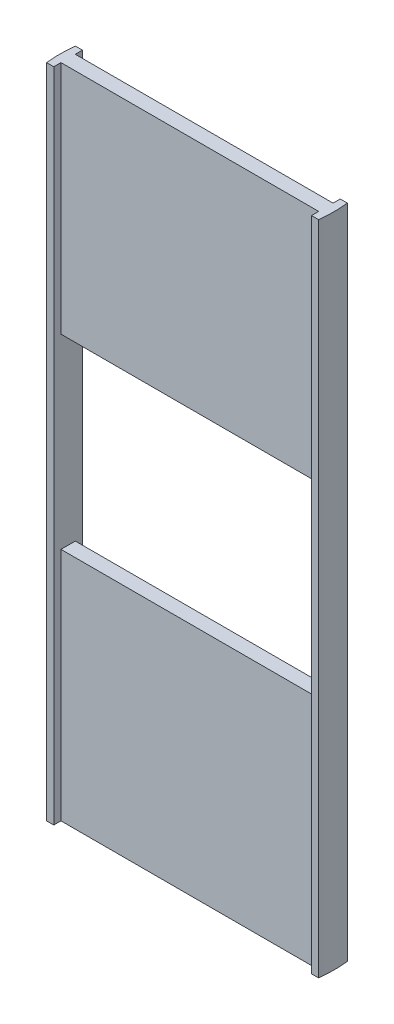
ISO-10303-21;
HEADER;
FILE_DESCRIPTION(('STEP AP214'),'2;1');
FILE_NAME('part.step','',(''),(''),'','','');
FILE_SCHEMA(('AUTOMOTIVE_DESIGN { 1 0 10303 214 1 1 1 1 }'));
ENDSEC;
DATA;
#1=APPLICATION_CONTEXT('core data for automotive mechanical design processes');
#2=APPLICATION_PROTOCOL_DEFINITION('international standard','automotive_design',2000,#1);
#3=PRODUCT_CONTEXT('',#1,'mechanical');
#4=PRODUCT('Part','Part','',(#3));
#5=PRODUCT_RELATED_PRODUCT_CATEGORY('part','',(#4));
#6=PRODUCT_DEFINITION_FORMATION('','',#4);
#7=PRODUCT_DEFINITION_CONTEXT('part definition',#1,'design');
#8=PRODUCT_DEFINITION('design','',#6,#7);
#9=PRODUCT_DEFINITION_SHAPE('','',#8);
#10=(LENGTH_UNIT() NAMED_UNIT(*) SI_UNIT(.MILLI.,.METRE.));
#11=(NAMED_UNIT(*) PLANE_ANGLE_UNIT() SI_UNIT($,.RADIAN.));
#12=(NAMED_UNIT(*) SI_UNIT($,.STERADIAN.) SOLID_ANGLE_UNIT());
#13=UNCERTAINTY_MEASURE_WITH_UNIT(LENGTH_MEASURE(1.E-05),#10,'distance_accuracy_value','');
#14=(GEOMETRIC_REPRESENTATION_CONTEXT(3) GLOBAL_UNCERTAINTY_ASSIGNED_CONTEXT((#13)) GLOBAL_UNIT_ASSIGNED_CONTEXT((#10,
#11,#12)) REPRESENTATION_CONTEXT('',''));
#15=CARTESIAN_POINT('',(0.,0.,0.));
#16=DIRECTION('',(0.,0.,1.));
#17=DIRECTION('',(1.,0.,0.));
#18=AXIS2_PLACEMENT_3D('',#15,#16,#17);
#19=CARTESIAN_POINT('',(89.7236111009288,0.,-5.));
#20=DIRECTION('',(0.,0.,-1.));
#21=DIRECTION('',(-1.,0.,0.));
#22=AXIS2_PLACEMENT_3D('',#19,#20,#21);
#23=PLANE('',#22);
#24=DIRECTION('',(-1.,0.,0.));
#25=VECTOR('',#24,1.);
#26=CARTESIAN_POINT('',(89.7236111009288,163.713787480197,-5.));
#27=LINE('',#26,#25);
#28=CARTESIAN_POINT('',(89.7236111009288,163.713787480197,-4.99999999999999));
#29=VERTEX_POINT('',#28);
#30=CARTESIAN_POINT('',(-89.7236111009288,163.713787480197,-4.99999999999998));
#31=VERTEX_POINT('',#30);
#32=EDGE_CURVE('E251',#29,#31,#27,.T.);
#33=ORIENTED_EDGE('',*,*,#32,.F.);
#34=DIRECTION('',(0.,1.,0.));
#35=VECTOR('',#34,1.);
#36=CARTESIAN_POINT('',(89.7236111009288,0.,-5.));
#37=LINE('',#36,#35);
#38=CARTESIAN_POINT('',(89.7236111009288,0.,-5.));
#39=VERTEX_POINT('',#38);
#40=EDGE_CURVE('E211',#39,#29,#37,.T.);
#41=ORIENTED_EDGE('',*,*,#40,.F.);
#42=DIRECTION('',(-1.,0.,0.));
#43=VECTOR('',#42,1.);
#44=CARTESIAN_POINT('',(89.7236111009288,0.,-5.));
#45=LINE('',#44,#43);
#46=CARTESIAN_POINT('',(-89.7236111009288,0.,-4.99999999999998));
#47=VERTEX_POINT('',#46);
#48=EDGE_CURVE('E178',#39,#47,#45,.T.);
#49=ORIENTED_EDGE('',*,*,#48,.T.);
#50=DIRECTION('',(0.,1.,0.));
#51=VECTOR('',#50,1.);
#52=CARTESIAN_POINT('',(-89.7236111009288,0.,-4.99999999999998));
#53=LINE('',#52,#51);
#54=EDGE_CURVE('E207',#47,#31,#53,.T.);
#55=ORIENTED_EDGE('',*,*,#54,.T.);
#56=EDGE_LOOP('',(#33,#41,#49,#55));
#57=FACE_BOUND('',#56,.T.);
#58=ADVANCED_FACE('F34',(#57),#23,.T.);
#59=CARTESIAN_POINT('',(0.,0.,5.));
#60=DIRECTION('',(0.,0.,-1.));
#61=DIRECTION('',(-1.,0.,0.));
#62=AXIS2_PLACEMENT_3D('',#59,#60,#61);
#63=PLANE('',#62);
#64=DIRECTION('',(0.,1.,0.));
#65=VECTOR('',#64,1.);
#66=CARTESIAN_POINT('',(89.7236111009288,0.,5.));
#67=LINE('',#66,#65);
#68=CARTESIAN_POINT('',(89.7236111009288,0.,5.));
#69=VERTEX_POINT('',#68);
#70=CARTESIAN_POINT('',(89.7236111009288,163.713787480197,5.));
#71=VERTEX_POINT('',#70);
#72=EDGE_CURVE('E191',#69,#71,#67,.T.);
#73=ORIENTED_EDGE('',*,*,#72,.T.);
#74=DIRECTION('',(-1.,0.,0.));
#75=VECTOR('',#74,1.);
#76=CARTESIAN_POINT('',(0.,163.713787480197,5.));
#77=LINE('',#76,#75);
#78=CARTESIAN_POINT('',(-89.7236111009288,163.713787480197,5.));
#79=VERTEX_POINT('',#78);
#80=EDGE_CURVE('E11',#71,#79,#77,.T.);
#81=ORIENTED_EDGE('',*,*,#80,.T.);
#82=DIRECTION('',(0.,1.,0.));
#83=VECTOR('',#82,1.);
#84=CARTESIAN_POINT('',(-89.7236111009288,0.,5.));
#85=LINE('',#84,#83);
#86=CARTESIAN_POINT('',(-89.7236111009288,0.,5.));
#87=VERTEX_POINT('',#86);
#88=EDGE_CURVE('E162',#87,#79,#85,.T.);
#89=ORIENTED_EDGE('',*,*,#88,.F.);
#90=DIRECTION('',(-1.,0.,0.));
#91=VECTOR('',#90,1.);
#92=CARTESIAN_POINT('',(0.,0.,5.));
#93=LINE('',#92,#91);
#94=EDGE_CURVE('E262',#69,#87,#93,.T.);
#95=ORIENTED_EDGE('',*,*,#94,.F.);
#96=EDGE_LOOP('',(#73,#81,#89,#95));
#97=FACE_BOUND('',#96,.T.);
#98=ADVANCED_FACE('F301',(#97),#63,.F.);
#99=CARTESIAN_POINT('',(0.,457.2,0.));
#100=DIRECTION('',(0.,-1.,0.));
#101=DIRECTION('',(0.,0.,-1.));
#102=AXIS2_PLACEMENT_3D('',#99,#100,#101);
#103=CYLINDRICAL_SURFACE('',#102,95.25);
#104=CARTESIAN_POINT('',(0.,457.2,0.));
#105=DIRECTION('',(0.,1.,0.));
#106=DIRECTION('',(0.,0.,1.));
#107=AXIS2_PLACEMENT_3D('',#104,#105,#106);
#108=CIRCLE('',#107,95.25);
#109=CARTESIAN_POINT('',(94.7236111009288,457.2,9.99999999999996));
#110=VERTEX_POINT('',#109);
#111=CARTESIAN_POINT('',(94.7236111009288,457.2,-9.99999999999999));
#112=VERTEX_POINT('',#111);
#113=EDGE_CURVE('E219',#110,#112,#108,.T.);
#114=ORIENTED_EDGE('',*,*,#113,.F.);
#115=DIRECTION('',(0.,1.,0.));
#116=VECTOR('',#115,1.);
#117=CARTESIAN_POINT('',(94.7236111009288,0.,9.99999999999996));
#118=LINE('',#117,#116);
#119=CARTESIAN_POINT('',(94.7236111009288,0.,9.99999999999996));
#120=VERTEX_POINT('',#119);
#121=EDGE_CURVE('E232',#120,#110,#118,.T.);
#122=ORIENTED_EDGE('',*,*,#121,.F.);
#123=CARTESIAN_POINT('',(0.,0.,0.));
#124=DIRECTION('',(0.,1.,0.));
#125=DIRECTION('',(0.,0.,1.));
#126=AXIS2_PLACEMENT_3D('',#123,#124,#125);
#127=CIRCLE('',#126,95.25);
#128=CARTESIAN_POINT('',(94.7236111009288,0.,-9.99999999999999));
#129=VERTEX_POINT('',#128);
#130=EDGE_CURVE('E216',#120,#129,#127,.T.);
#131=ORIENTED_EDGE('',*,*,#130,.T.);
#132=DIRECTION('',(0.,1.,0.));
#133=VECTOR('',#132,1.);
#134=CARTESIAN_POINT('',(94.7236111009288,0.,-9.99999999999999));
#135=LINE('',#134,#133);
#136=EDGE_CURVE('E186',#129,#112,#135,.T.);
#137=ORIENTED_EDGE('',*,*,#136,.T.);
#138=EDGE_LOOP('',(#114,#122,#131,#137));
#139=FACE_BOUND('',#138,.T.);
#140=ADVANCED_FACE('F231',(#139),#103,.T.);
#141=CARTESIAN_POINT('',(-94.7236111009288,0.,-10.));
#142=VERTEX_POINT('',#141);
#143=CARTESIAN_POINT('',(-94.7236111009288,0.,10.));
#144=VERTEX_POINT('',#143);
#145=EDGE_CURVE('E220',#142,#144,#127,.T.);
#146=ORIENTED_EDGE('',*,*,#145,.T.);
#147=DIRECTION('',(0.,1.,0.));
#148=VECTOR('',#147,1.);
#149=CARTESIAN_POINT('',(-94.7236111009288,0.,10.));
#150=LINE('',#149,#148);
#151=CARTESIAN_POINT('',(-94.7236111009288,457.2,10.));
#152=VERTEX_POINT('',#151);
#153=EDGE_CURVE('E286',#144,#152,#150,.T.);
#154=ORIENTED_EDGE('',*,*,#153,.T.);
#155=CARTESIAN_POINT('',(-94.7236111009288,457.2,-10.));
#156=VERTEX_POINT('',#155);
#157=EDGE_CURVE('E147',#156,#152,#108,.T.);
#158=ORIENTED_EDGE('',*,*,#157,.F.);
#159=DIRECTION('',(0.,1.,0.));
#160=VECTOR('',#159,1.);
#161=CARTESIAN_POINT('',(-94.7236111009288,0.,-10.));
#162=LINE('',#161,#160);
#163=EDGE_CURVE('E203',#142,#156,#162,.T.);
#164=ORIENTED_EDGE('',*,*,#163,.F.);
#165=EDGE_LOOP('',(#146,#154,#158,#164));
#166=FACE_BOUND('',#165,.T.);
#167=ADVANCED_FACE('F36',(#166),#103,.T.);
#168=CARTESIAN_POINT('',(0.,457.2,0.));
#169=DIRECTION('',(0.,1.,0.));
#170=DIRECTION('',(0.,0.,1.));
#171=AXIS2_PLACEMENT_3D('',#168,#169,#170);
#172=PLANE('',#171);
#173=DIRECTION('',(-1.,0.,0.));
#174=VECTOR('',#173,1.);
#175=CARTESIAN_POINT('',(94.7236111009288,457.2,10.));
#176=LINE('',#175,#174);
#177=CARTESIAN_POINT('',(89.7236111009288,457.2,10.));
#178=VERTEX_POINT('',#177);
#179=EDGE_CURVE('E276',#110,#178,#176,.T.);
#180=ORIENTED_EDGE('',*,*,#179,.F.);
#181=ORIENTED_EDGE('',*,*,#113,.T.);
#182=DIRECTION('',(-1.,0.,0.));
#183=VECTOR('',#182,1.);
#184=CARTESIAN_POINT('',(94.7236111009288,457.2,-10.));
#185=LINE('',#184,#183);
#186=CARTESIAN_POINT('',(89.7236111009288,457.2,-10.));
#187=VERTEX_POINT('',#186);
#188=EDGE_CURVE('E187',#112,#187,#185,.T.);
#189=ORIENTED_EDGE('',*,*,#188,.T.);
#190=DIRECTION('',(0.,0.,1.));
#191=VECTOR('',#190,1.);
#192=CARTESIAN_POINT('',(89.7236111009288,457.2,-10.));
#193=LINE('',#192,#191);
#194=CARTESIAN_POINT('',(89.7236111009288,457.2,-5.));
#195=VERTEX_POINT('',#194);
#196=EDGE_CURVE('E190',#187,#195,#193,.T.);
#197=ORIENTED_EDGE('',*,*,#196,.T.);
#198=DIRECTION('',(-1.,0.,0.));
#199=VECTOR('',#198,1.);
#200=CARTESIAN_POINT('',(89.7236111009288,457.2,-5.));
#201=LINE('',#200,#199);
#202=CARTESIAN_POINT('',(-89.7236111009288,457.2,-4.99999999999998));
#203=VERTEX_POINT('',#202);
#204=EDGE_CURVE('E194',#195,#203,#201,.T.);
#205=ORIENTED_EDGE('',*,*,#204,.T.);
#206=DIRECTION('',(0.,0.,1.));
#207=VECTOR('',#206,1.);
#208=CARTESIAN_POINT('',(-89.7236111009288,457.2,-10.));
#209=LINE('',#208,#207);
#210=CARTESIAN_POINT('',(-89.7236111009288,457.2,-10.));
#211=VERTEX_POINT('',#210);
#212=EDGE_CURVE('E197',#211,#203,#209,.T.);
#213=ORIENTED_EDGE('',*,*,#212,.F.);
#214=DIRECTION('',(1.,0.,0.));
#215=VECTOR('',#214,1.);
#216=CARTESIAN_POINT('',(-94.7236111009288,457.2,-10.));
#217=LINE('',#216,#215);
#218=EDGE_CURVE('E176',#156,#211,#217,.T.);
#219=ORIENTED_EDGE('',*,*,#218,.F.);
#220=ORIENTED_EDGE('',*,*,#157,.T.);
#221=DIRECTION('',(-1.,0.,0.));
#222=VECTOR('',#221,1.);
#223=CARTESIAN_POINT('',(-89.7236111009288,457.2,10.));
#224=LINE('',#223,#222);
#225=CARTESIAN_POINT('',(-89.7236111009288,457.2,10.));
#226=VERTEX_POINT('',#225);
#227=EDGE_CURVE('E274',#226,#152,#224,.T.);
#228=ORIENTED_EDGE('',*,*,#227,.F.);
#229=DIRECTION('',(0.,0.,1.));
#230=VECTOR('',#229,1.);
#231=CARTESIAN_POINT('',(-89.7236111009288,457.2,5.));
#232=LINE('',#231,#230);
#233=CARTESIAN_POINT('',(-89.7236111009288,457.2,5.));
#234=VERTEX_POINT('',#233);
#235=EDGE_CURVE('E256',#234,#226,#232,.T.);
#236=ORIENTED_EDGE('',*,*,#235,.F.);
#237=DIRECTION('',(-1.,0.,0.));
#238=VECTOR('',#237,1.);
#239=CARTESIAN_POINT('',(0.,457.2,5.));
#240=LINE('',#239,#238);
#241=CARTESIAN_POINT('',(89.7236111009288,457.2,5.));
#242=VERTEX_POINT('',#241);
#243=EDGE_CURVE('E160',#242,#234,#240,.T.);
#244=ORIENTED_EDGE('',*,*,#243,.F.);
#245=DIRECTION('',(0.,0.,-1.));
#246=VECTOR('',#245,1.);
#247=CARTESIAN_POINT('',(89.7236111009288,457.2,5.));
#248=LINE('',#247,#246);
#249=EDGE_CURVE('E266',#178,#242,#248,.T.);
#250=ORIENTED_EDGE('',*,*,#249,.F.);
#251=EDGE_LOOP('',(#180,#181,#189,#197,#205,#213,#219,#220,#228,#236,#244,#250));
#252=FACE_BOUND('',#251,.T.);
#253=ADVANCED_FACE('F294',(#252),#172,.T.);
#254=CARTESIAN_POINT('',(0.,0.,0.));
#255=DIRECTION('',(0.,1.,0.));
#256=DIRECTION('',(0.,0.,1.));
#257=AXIS2_PLACEMENT_3D('',#254,#255,#256);
#258=PLANE('',#257);
#259=ORIENTED_EDGE('',*,*,#130,.F.);
#260=DIRECTION('',(-1.,0.,0.));
#261=VECTOR('',#260,1.);
#262=CARTESIAN_POINT('',(94.7236111009288,0.,10.));
#263=LINE('',#262,#261);
#264=CARTESIAN_POINT('',(89.7236111009288,0.,10.));
#265=VERTEX_POINT('',#264);
#266=EDGE_CURVE('E168',#120,#265,#263,.T.);
#267=ORIENTED_EDGE('',*,*,#266,.T.);
#268=DIRECTION('',(0.,0.,-1.));
#269=VECTOR('',#268,1.);
#270=CARTESIAN_POINT('',(89.7236111009288,0.,5.));
#271=LINE('',#270,#269);
#272=EDGE_CURVE('E163',#265,#69,#271,.T.);
#273=ORIENTED_EDGE('',*,*,#272,.T.);
#274=ORIENTED_EDGE('',*,*,#94,.T.);
#275=DIRECTION('',(0.,0.,1.));
#276=VECTOR('',#275,1.);
#277=CARTESIAN_POINT('',(-89.7236111009288,0.,5.));
#278=LINE('',#277,#276);
#279=CARTESIAN_POINT('',(-89.7236111009288,0.,10.));
#280=VERTEX_POINT('',#279);
#281=EDGE_CURVE('E265',#87,#280,#278,.T.);
#282=ORIENTED_EDGE('',*,*,#281,.T.);
#283=DIRECTION('',(-1.,0.,0.));
#284=VECTOR('',#283,1.);
#285=CARTESIAN_POINT('',(-89.7236111009288,0.,10.));
#286=LINE('',#285,#284);
#287=EDGE_CURVE('E269',#280,#144,#286,.T.);
#288=ORIENTED_EDGE('',*,*,#287,.T.);
#289=ORIENTED_EDGE('',*,*,#145,.F.);
#290=DIRECTION('',(1.,0.,0.));
#291=VECTOR('',#290,1.);
#292=CARTESIAN_POINT('',(-94.7236111009288,0.,-10.));
#293=LINE('',#292,#291);
#294=CARTESIAN_POINT('',(-89.7236111009288,0.,-10.));
#295=VERTEX_POINT('',#294);
#296=EDGE_CURVE('E183',#142,#295,#293,.T.);
#297=ORIENTED_EDGE('',*,*,#296,.T.);
#298=DIRECTION('',(0.,0.,1.));
#299=VECTOR('',#298,1.);
#300=CARTESIAN_POINT('',(-89.7236111009288,0.,-10.));
#301=LINE('',#300,#299);
#302=EDGE_CURVE('E180',#295,#47,#301,.T.);
#303=ORIENTED_EDGE('',*,*,#302,.T.);
#304=ORIENTED_EDGE('',*,*,#48,.F.);
#305=DIRECTION('',(0.,0.,1.));
#306=VECTOR('',#305,1.);
#307=CARTESIAN_POINT('',(89.7236111009288,0.,-10.));
#308=LINE('',#307,#306);
#309=CARTESIAN_POINT('',(89.7236111009288,0.,-10.));
#310=VERTEX_POINT('',#309);
#311=EDGE_CURVE('E175',#310,#39,#308,.T.);
#312=ORIENTED_EDGE('',*,*,#311,.F.);
#313=DIRECTION('',(-1.,0.,0.));
#314=VECTOR('',#313,1.);
#315=CARTESIAN_POINT('',(94.7236111009288,0.,-10.));
#316=LINE('',#315,#314);
#317=EDGE_CURVE('E173',#129,#310,#316,.T.);
#318=ORIENTED_EDGE('',*,*,#317,.F.);
#319=EDGE_LOOP('',(#259,#267,#273,#274,#282,#288,#289,#297,#303,#304,#312,#318));
#320=FACE_BOUND('',#319,.T.);
#321=ADVANCED_FACE('F241',(#320),#258,.F.);
#322=CARTESIAN_POINT('',(94.7236111009288,0.,-10.));
#323=DIRECTION('',(0.,0.,-1.));
#324=DIRECTION('',(-1.,0.,0.));
#325=AXIS2_PLACEMENT_3D('',#322,#323,#324);
#326=PLANE('',#325);
#327=ORIENTED_EDGE('',*,*,#188,.F.);
#328=ORIENTED_EDGE('',*,*,#136,.F.);
#329=ORIENTED_EDGE('',*,*,#317,.T.);
#330=DIRECTION('',(0.,1.,0.));
#331=VECTOR('',#330,1.);
#332=CARTESIAN_POINT('',(89.7236111009288,0.,-10.));
#333=LINE('',#332,#331);
#334=EDGE_CURVE('E214',#310,#187,#333,.T.);
#335=ORIENTED_EDGE('',*,*,#334,.T.);
#336=EDGE_LOOP('',(#327,#328,#329,#335));
#337=FACE_BOUND('',#336,.T.);
#338=ADVANCED_FACE('F238',(#337),#326,.T.);
#339=CARTESIAN_POINT('',(89.7236111009288,0.,-10.));
#340=DIRECTION('',(-1.,0.,0.));
#341=DIRECTION('',(0.,0.,1.));
#342=AXIS2_PLACEMENT_3D('',#339,#340,#341);
#343=PLANE('',#342);
#344=ORIENTED_EDGE('',*,*,#196,.F.);
#345=ORIENTED_EDGE('',*,*,#334,.F.);
#346=ORIENTED_EDGE('',*,*,#311,.T.);
#347=ORIENTED_EDGE('',*,*,#40,.T.);
#348=DIRECTION('',(0.,0.,1.));
#349=VECTOR('',#348,1.);
#350=CARTESIAN_POINT('',(89.7236111009288,163.713787480197,-10.));
#351=LINE('',#350,#349);
#352=EDGE_CURVE('E258',#29,#71,#351,.T.);
#353=ORIENTED_EDGE('',*,*,#352,.T.);
#354=ORIENTED_EDGE('',*,*,#72,.F.);
#355=ORIENTED_EDGE('',*,*,#272,.F.);
#356=DIRECTION('',(0.,1.,0.));
#357=VECTOR('',#356,1.);
#358=CARTESIAN_POINT('',(89.7236111009288,0.,10.));
#359=LINE('',#358,#357);
#360=EDGE_CURVE('E284',#265,#178,#359,.T.);
#361=ORIENTED_EDGE('',*,*,#360,.T.);
#362=ORIENTED_EDGE('',*,*,#249,.T.);
#363=CARTESIAN_POINT('',(89.7236111009288,293.486212519803,5.));
#364=VERTEX_POINT('',#363);
#365=EDGE_CURVE('E283',#364,#242,#67,.T.);
#366=ORIENTED_EDGE('',*,*,#365,.F.);
#367=DIRECTION('',(0.,0.,1.));
#368=VECTOR('',#367,1.);
#369=CARTESIAN_POINT('',(89.7236111009288,293.486212519803,-10.));
#370=LINE('',#369,#368);
#371=CARTESIAN_POINT('',(89.7236111009288,293.486212519803,-4.99999999999999));
#372=VERTEX_POINT('',#371);
#373=EDGE_CURVE('E54',#372,#364,#370,.T.);
#374=ORIENTED_EDGE('',*,*,#373,.F.);
#375=EDGE_CURVE('E210',#372,#195,#37,.T.);
#376=ORIENTED_EDGE('',*,*,#375,.T.);
#377=EDGE_LOOP('',(#344,#345,#346,#347,#353,#354,#355,#361,#362,#366,#374,#376));
#378=FACE_BOUND('',#377,.T.);
#379=ADVANCED_FACE('F246',(#378),#343,.T.);
#380=DIRECTION('',(1.,0.,0.));
#381=VECTOR('',#380,1.);
#382=CARTESIAN_POINT('',(89.7236111009288,293.486212519803,-5.));
#383=LINE('',#382,#381);
#384=CARTESIAN_POINT('',(-89.7236111009288,293.486212519803,-4.99999999999998));
#385=VERTEX_POINT('',#384);
#386=EDGE_CURVE('E254',#385,#372,#383,.T.);
#387=ORIENTED_EDGE('',*,*,#386,.F.);
#388=EDGE_CURVE('E155',#385,#203,#53,.T.);
#389=ORIENTED_EDGE('',*,*,#388,.T.);
#390=ORIENTED_EDGE('',*,*,#204,.F.);
#391=ORIENTED_EDGE('',*,*,#375,.F.);
#392=EDGE_LOOP('',(#387,#389,#390,#391));
#393=FACE_BOUND('',#392,.T.);
#394=ADVANCED_FACE('F312',(#393),#23,.T.);
#395=CARTESIAN_POINT('',(-89.7236111009288,0.,-10.));
#396=DIRECTION('',(-1.,0.,0.));
#397=DIRECTION('',(0.,0.,1.));
#398=AXIS2_PLACEMENT_3D('',#395,#396,#397);
#399=PLANE('',#398);
#400=ORIENTED_EDGE('',*,*,#388,.F.);
#401=DIRECTION('',(0.,0.,1.));
#402=VECTOR('',#401,1.);
#403=CARTESIAN_POINT('',(-89.7236111009288,293.486212519803,-10.));
#404=LINE('',#403,#402);
#405=CARTESIAN_POINT('',(-89.7236111009288,293.486212519803,5.));
#406=VERTEX_POINT('',#405);
#407=EDGE_CURVE('E49',#385,#406,#404,.T.);
#408=ORIENTED_EDGE('',*,*,#407,.T.);
#409=EDGE_CURVE('E152',#406,#234,#85,.T.);
#410=ORIENTED_EDGE('',*,*,#409,.T.);
#411=ORIENTED_EDGE('',*,*,#235,.T.);
#412=DIRECTION('',(0.,1.,0.));
#413=VECTOR('',#412,1.);
#414=CARTESIAN_POINT('',(-89.7236111009288,0.,10.));
#415=LINE('',#414,#413);
#416=EDGE_CURVE('E166',#280,#226,#415,.T.);
#417=ORIENTED_EDGE('',*,*,#416,.F.);
#418=ORIENTED_EDGE('',*,*,#281,.F.);
#419=ORIENTED_EDGE('',*,*,#88,.T.);
#420=DIRECTION('',(0.,0.,1.));
#421=VECTOR('',#420,1.);
#422=CARTESIAN_POINT('',(-89.7236111009288,163.713787480197,-10.));
#423=LINE('',#422,#421);
#424=EDGE_CURVE('E156',#31,#79,#423,.T.);
#425=ORIENTED_EDGE('',*,*,#424,.F.);
#426=ORIENTED_EDGE('',*,*,#54,.F.);
#427=ORIENTED_EDGE('',*,*,#302,.F.);
#428=DIRECTION('',(0.,1.,0.));
#429=VECTOR('',#428,1.);
#430=CARTESIAN_POINT('',(-89.7236111009288,0.,-10.));
#431=LINE('',#430,#429);
#432=EDGE_CURVE('E205',#295,#211,#431,.T.);
#433=ORIENTED_EDGE('',*,*,#432,.T.);
#434=ORIENTED_EDGE('',*,*,#212,.T.);
#435=EDGE_LOOP('',(#400,#408,#410,#411,#417,#418,#419,#425,#426,#427,#433,#434));
#436=FACE_BOUND('',#435,.T.);
#437=ADVANCED_FACE('F150',(#436),#399,.F.);
#438=CARTESIAN_POINT('',(-94.7236111009288,0.,-10.));
#439=DIRECTION('',(0.,0.,1.));
#440=DIRECTION('',(1.,0.,0.));
#441=AXIS2_PLACEMENT_3D('',#438,#439,#440);
#442=PLANE('',#441);
#443=ORIENTED_EDGE('',*,*,#218,.T.);
#444=ORIENTED_EDGE('',*,*,#432,.F.);
#445=ORIENTED_EDGE('',*,*,#296,.F.);
#446=ORIENTED_EDGE('',*,*,#163,.T.);
#447=EDGE_LOOP('',(#443,#444,#445,#446));
#448=FACE_BOUND('',#447,.T.);
#449=ADVANCED_FACE('F314',(#448),#442,.F.);
#450=CARTESIAN_POINT('',(94.7236111009288,0.,10.));
#451=DIRECTION('',(0.,0.,-1.));
#452=DIRECTION('',(-1.,0.,0.));
#453=AXIS2_PLACEMENT_3D('',#450,#451,#452);
#454=PLANE('',#453);
#455=ORIENTED_EDGE('',*,*,#179,.T.);
#456=ORIENTED_EDGE('',*,*,#360,.F.);
#457=ORIENTED_EDGE('',*,*,#266,.F.);
#458=ORIENTED_EDGE('',*,*,#121,.T.);
#459=EDGE_LOOP('',(#455,#456,#457,#458));
#460=FACE_BOUND('',#459,.T.);
#461=ADVANCED_FACE('F307',(#460),#454,.F.);
#462=CARTESIAN_POINT('',(-89.7236111009288,0.,10.));
#463=DIRECTION('',(0.,0.,-1.));
#464=DIRECTION('',(-1.,0.,0.));
#465=AXIS2_PLACEMENT_3D('',#462,#463,#464);
#466=PLANE('',#465);
#467=ORIENTED_EDGE('',*,*,#227,.T.);
#468=ORIENTED_EDGE('',*,*,#153,.F.);
#469=ORIENTED_EDGE('',*,*,#287,.F.);
#470=ORIENTED_EDGE('',*,*,#416,.T.);
#471=EDGE_LOOP('',(#467,#468,#469,#470));
#472=FACE_BOUND('',#471,.T.);
#473=ADVANCED_FACE('F290',(#472),#466,.F.);
#474=ORIENTED_EDGE('',*,*,#409,.F.);
#475=DIRECTION('',(1.,0.,0.));
#476=VECTOR('',#475,1.);
#477=CARTESIAN_POINT('',(0.,293.486212519803,5.));
#478=LINE('',#477,#476);
#479=EDGE_CURVE('E42',#406,#364,#478,.T.);
#480=ORIENTED_EDGE('',*,*,#479,.T.);
#481=ORIENTED_EDGE('',*,*,#365,.T.);
#482=ORIENTED_EDGE('',*,*,#243,.T.);
#483=EDGE_LOOP('',(#474,#480,#481,#482));
#484=FACE_BOUND('',#483,.T.);
#485=ADVANCED_FACE('F158',(#484),#63,.F.);
#486=CARTESIAN_POINT('',(-89.7236111009288,163.713787480197,-10.));
#487=DIRECTION('',(0.,-1.,0.));
#488=DIRECTION('',(0.,0.,-1.));
#489=AXIS2_PLACEMENT_3D('',#486,#487,#488);
#490=PLANE('',#489);
#491=ORIENTED_EDGE('',*,*,#32,.T.);
#492=ORIENTED_EDGE('',*,*,#424,.T.);
#493=ORIENTED_EDGE('',*,*,#80,.F.);
#494=ORIENTED_EDGE('',*,*,#352,.F.);
#495=EDGE_LOOP('',(#491,#492,#493,#494));
#496=FACE_BOUND('',#495,.T.);
#497=ADVANCED_FACE('F302',(#496),#490,.F.);
#498=CARTESIAN_POINT('',(-89.7236111009288,293.486212519803,-10.));
#499=DIRECTION('',(0.,1.,0.));
#500=DIRECTION('',(0.,0.,1.));
#501=AXIS2_PLACEMENT_3D('',#498,#499,#500);
#502=PLANE('',#501);
#503=ORIENTED_EDGE('',*,*,#386,.T.);
#504=ORIENTED_EDGE('',*,*,#373,.T.);
#505=ORIENTED_EDGE('',*,*,#479,.F.);
#506=ORIENTED_EDGE('',*,*,#407,.F.);
#507=EDGE_LOOP('',(#503,#504,#505,#506));
#508=FACE_BOUND('',#507,.T.);
#509=ADVANCED_FACE('F143',(#508),#502,.F.);
#510=CLOSED_SHELL('',(#58,#98,#140,#167,#253,#321,#338,#379,#394,#437,#449,#461,#473,#485,#497,#509));
#511=MANIFOLD_SOLID_BREP('B2',#510);
#512=ADVANCED_BREP_SHAPE_REPRESENTATION('',(#18,#511),#14);
#513=SHAPE_DEFINITION_REPRESENTATION(#9,#512);
ENDSEC;
END-ISO-10303-21;
